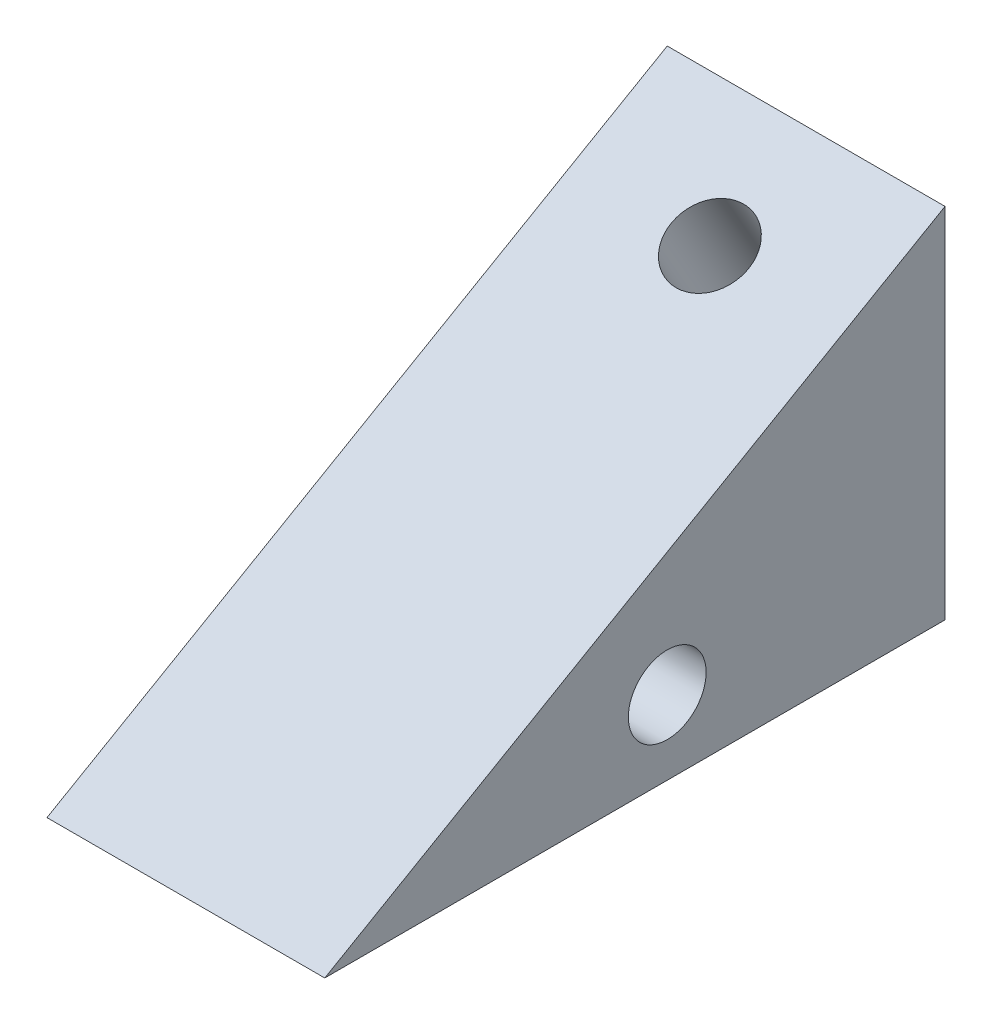
ISO-10303-21;
HEADER;
FILE_DESCRIPTION(('STEP AP214'),'2;1');
FILE_NAME('part.step','',(''),(''),'','','');
FILE_SCHEMA(('AUTOMOTIVE_DESIGN { 1 0 10303 214 1 1 1 1 }'));
ENDSEC;
DATA;
#1=APPLICATION_CONTEXT('core data for automotive mechanical design processes');
#2=APPLICATION_PROTOCOL_DEFINITION('international standard','automotive_design',2000,#1);
#3=PRODUCT_CONTEXT('',#1,'mechanical');
#4=PRODUCT('Part','Part','',(#3));
#5=PRODUCT_RELATED_PRODUCT_CATEGORY('part','',(#4));
#6=PRODUCT_DEFINITION_FORMATION('','',#4);
#7=PRODUCT_DEFINITION_CONTEXT('part definition',#1,'design');
#8=PRODUCT_DEFINITION('design','',#6,#7);
#9=PRODUCT_DEFINITION_SHAPE('','',#8);
#10=(LENGTH_UNIT() NAMED_UNIT(*) SI_UNIT(.MILLI.,.METRE.));
#11=(NAMED_UNIT(*) PLANE_ANGLE_UNIT() SI_UNIT($,.RADIAN.));
#12=(NAMED_UNIT(*) SI_UNIT($,.STERADIAN.) SOLID_ANGLE_UNIT());
#13=UNCERTAINTY_MEASURE_WITH_UNIT(LENGTH_MEASURE(1.E-05),#10,'distance_accuracy_value','');
#14=(GEOMETRIC_REPRESENTATION_CONTEXT(3) GLOBAL_UNCERTAINTY_ASSIGNED_CONTEXT((#13)) GLOBAL_UNIT_ASSIGNED_CONTEXT((#10,
#11,#12)) REPRESENTATION_CONTEXT('',''));
#15=CARTESIAN_POINT('',(0.,0.,0.));
#16=DIRECTION('',(0.,0.,1.));
#17=DIRECTION('',(1.,0.,0.));
#18=AXIS2_PLACEMENT_3D('',#15,#16,#17);
#19=CARTESIAN_POINT('',(15.,19.3357244163885,0.));
#20=DIRECTION('',(0.,0.,1.));
#21=DIRECTION('',(0.,-1.,0.));
#22=AXIS2_PLACEMENT_3D('',#19,#20,#21);
#23=PLANE('',#22);
#24=CARTESIAN_POINT('',(7.5,7.33572441638833,0.));
#25=DIRECTION('',(0.,0.,1.));
#26=DIRECTION('',(0.,1.,0.));
#27=AXIS2_PLACEMENT_3D('',#24,#25,#26);
#28=ELLIPSE('',#27,4.20000000000003,2.09999999999999);
#29=CARTESIAN_POINT('',(7.5,11.5357244163884,0.));
#30=VERTEX_POINT('',#29);
#31=EDGE_CURVE('E135',#30,#30,#28,.T.);
#32=ORIENTED_EDGE('',*,*,#31,.T.);
#33=EDGE_LOOP('',(#32));
#34=FACE_BOUND('',#33,.T.);
#35=DIRECTION('',(0.,1.,0.));
#36=VECTOR('',#35,1.);
#37=CARTESIAN_POINT('',(0.,19.3357244163885,0.));
#38=LINE('',#37,#36);
#39=CARTESIAN_POINT('',(0.,0.,0.));
#40=VERTEX_POINT('',#39);
#41=CARTESIAN_POINT('',(0.,19.3357244163885,0.));
#42=VERTEX_POINT('',#41);
#43=EDGE_CURVE('E93',#40,#42,#38,.T.);
#44=ORIENTED_EDGE('',*,*,#43,.T.);
#45=DIRECTION('',(-1.,0.,0.));
#46=VECTOR('',#45,1.);
#47=CARTESIAN_POINT('',(15.,19.3357244163885,0.));
#48=LINE('',#47,#46);
#49=CARTESIAN_POINT('',(15.,19.3357244163885,0.));
#50=VERTEX_POINT('',#49);
#51=EDGE_CURVE('E11',#50,#42,#48,.T.);
#52=ORIENTED_EDGE('',*,*,#51,.F.);
#53=DIRECTION('',(0.,1.,0.));
#54=VECTOR('',#53,1.);
#55=CARTESIAN_POINT('',(15.,19.3357244163885,0.));
#56=LINE('',#55,#54);
#57=CARTESIAN_POINT('',(15.,0.,0.));
#58=VERTEX_POINT('',#57);
#59=EDGE_CURVE('E85',#58,#50,#56,.T.);
#60=ORIENTED_EDGE('',*,*,#59,.F.);
#61=DIRECTION('',(-1.,0.,0.));
#62=VECTOR('',#61,1.);
#63=CARTESIAN_POINT('',(15.,0.,0.));
#64=LINE('',#63,#62);
#65=EDGE_CURVE('E94',#58,#40,#64,.T.);
#66=ORIENTED_EDGE('',*,*,#65,.T.);
#67=EDGE_LOOP('',(#44,#52,#60,#66));
#68=FACE_BOUND('',#67,.T.);
#69=ADVANCED_FACE('F43',(#34,#68),#23,.F.);
#70=CARTESIAN_POINT('',(15.,0.,33.4904570903353));
#71=DIRECTION('',(0.,-0.866025403784441,-0.499999999999995));
#72=DIRECTION('',(0.,0.499999999999995,-0.866025403784442));
#73=AXIS2_PLACEMENT_3D('',#70,#71,#72);
#74=PLANE('',#73);
#75=CARTESIAN_POINT('',(7.5,16.3357244163885,5.19615242270666));
#76=DIRECTION('',(0.,0.866025403784441,0.499999999999995));
#77=DIRECTION('',(0.,-0.499999999999995,0.866025403784441));
#78=AXIS2_PLACEMENT_3D('',#75,#76,#77);
#79=CIRCLE('',#78,2.09999999999999);
#80=CARTESIAN_POINT('',(7.5,15.2857244163885,7.01480577065398));
#81=VERTEX_POINT('',#80);
#82=EDGE_CURVE('E138',#81,#81,#79,.T.);
#83=ORIENTED_EDGE('',*,*,#82,.F.);
#84=EDGE_LOOP('',(#83));
#85=FACE_BOUND('',#84,.T.);
#86=DIRECTION('',(0.,-0.499999999999995,0.866025403784442));
#87=VECTOR('',#86,1.);
#88=CARTESIAN_POINT('',(0.,0.,33.4904570903353));
#89=LINE('',#88,#87);
#90=CARTESIAN_POINT('',(0.,0.,33.4904570903353));
#91=VERTEX_POINT('',#90);
#92=EDGE_CURVE('E72',#42,#91,#89,.T.);
#93=ORIENTED_EDGE('',*,*,#92,.T.);
#94=DIRECTION('',(-1.,0.,0.));
#95=VECTOR('',#94,1.);
#96=CARTESIAN_POINT('',(15.,0.,33.4904570903353));
#97=LINE('',#96,#95);
#98=CARTESIAN_POINT('',(15.,0.,33.4904570903353));
#99=VERTEX_POINT('',#98);
#100=EDGE_CURVE('E52',#99,#91,#97,.T.);
#101=ORIENTED_EDGE('',*,*,#100,.F.);
#102=DIRECTION('',(0.,-0.499999999999995,0.866025403784442));
#103=VECTOR('',#102,1.);
#104=CARTESIAN_POINT('',(15.,0.,33.4904570903353));
#105=LINE('',#104,#103);
#106=EDGE_CURVE('E80',#50,#99,#105,.T.);
#107=ORIENTED_EDGE('',*,*,#106,.F.);
#108=ORIENTED_EDGE('',*,*,#51,.T.);
#109=EDGE_LOOP('',(#93,#101,#107,#108));
#110=FACE_BOUND('',#109,.T.);
#111=ADVANCED_FACE('F81',(#85,#110),#74,.F.);
#112=CARTESIAN_POINT('',(15.,0.,0.));
#113=DIRECTION('',(0.,1.,0.));
#114=DIRECTION('',(0.,0.,1.));
#115=AXIS2_PLACEMENT_3D('',#112,#113,#114);
#116=PLANE('',#115);
#117=DIRECTION('',(0.,0.,-1.));
#118=VECTOR('',#117,1.);
#119=CARTESIAN_POINT('',(0.,0.,0.));
#120=LINE('',#119,#118);
#121=EDGE_CURVE('E77',#91,#40,#120,.T.);
#122=ORIENTED_EDGE('',*,*,#121,.T.);
#123=ORIENTED_EDGE('',*,*,#65,.F.);
#124=DIRECTION('',(0.,0.,-1.));
#125=VECTOR('',#124,1.);
#126=CARTESIAN_POINT('',(15.,0.,0.));
#127=LINE('',#126,#125);
#128=EDGE_CURVE('E60',#99,#58,#127,.T.);
#129=ORIENTED_EDGE('',*,*,#128,.F.);
#130=ORIENTED_EDGE('',*,*,#100,.T.);
#131=EDGE_LOOP('',(#122,#123,#129,#130));
#132=FACE_BOUND('',#131,.T.);
#133=ADVANCED_FACE('F111',(#132),#116,.F.);
#134=CARTESIAN_POINT('',(15.,0.,0.));
#135=DIRECTION('',(-1.,0.,0.));
#136=DIRECTION('',(0.,0.,1.));
#137=AXIS2_PLACEMENT_3D('',#134,#135,#136);
#138=PLANE('',#137);
#139=CARTESIAN_POINT('',(15.,4.,15.));
#140=DIRECTION('',(1.,0.,0.));
#141=DIRECTION('',(0.,0.,-1.));
#142=AXIS2_PLACEMENT_3D('',#139,#140,#141);
#143=CIRCLE('',#142,2.09999999999999);
#144=CARTESIAN_POINT('',(15.,4.,12.9));
#145=VERTEX_POINT('',#144);
#146=EDGE_CURVE('E103',#145,#145,#143,.T.);
#147=ORIENTED_EDGE('',*,*,#146,.F.);
#148=EDGE_LOOP('',(#147));
#149=FACE_BOUND('',#148,.T.);
#150=ORIENTED_EDGE('',*,*,#59,.T.);
#151=ORIENTED_EDGE('',*,*,#106,.T.);
#152=ORIENTED_EDGE('',*,*,#128,.T.);
#153=EDGE_LOOP('',(#150,#151,#152));
#154=FACE_BOUND('',#153,.T.);
#155=ADVANCED_FACE('F88',(#149,#154),#138,.F.);
#156=CARTESIAN_POINT('',(0.,0.,0.));
#157=DIRECTION('',(-1.,0.,0.));
#158=DIRECTION('',(0.,0.,1.));
#159=AXIS2_PLACEMENT_3D('',#156,#157,#158);
#160=PLANE('',#159);
#161=CARTESIAN_POINT('',(0.,4.,15.));
#162=DIRECTION('',(1.,0.,0.));
#163=DIRECTION('',(0.,0.,-1.));
#164=AXIS2_PLACEMENT_3D('',#161,#162,#163);
#165=CIRCLE('',#164,2.1);
#166=CARTESIAN_POINT('',(0.,4.,12.9));
#167=VERTEX_POINT('',#166);
#168=EDGE_CURVE('E97',#167,#167,#165,.T.);
#169=ORIENTED_EDGE('',*,*,#168,.T.);
#170=EDGE_LOOP('',(#169));
#171=FACE_BOUND('',#170,.T.);
#172=ORIENTED_EDGE('',*,*,#43,.F.);
#173=ORIENTED_EDGE('',*,*,#121,.F.);
#174=ORIENTED_EDGE('',*,*,#92,.F.);
#175=EDGE_LOOP('',(#172,#173,#174));
#176=FACE_BOUND('',#175,.T.);
#177=ADVANCED_FACE('F112',(#171,#176),#160,.T.);
#178=CARTESIAN_POINT('',(15.,4.,15.));
#179=DIRECTION('',(1.,0.,0.));
#180=DIRECTION('',(0.,0.,-1.));
#181=AXIS2_PLACEMENT_3D('',#178,#179,#180);
#182=CYLINDRICAL_SURFACE('',#181,2.09999999999999);
#183=ORIENTED_EDGE('',*,*,#168,.F.);
#184=EDGE_LOOP('',(#183));
#185=FACE_BOUND('',#184,.T.);
#186=ORIENTED_EDGE('',*,*,#146,.T.);
#187=EDGE_LOOP('',(#186));
#188=FACE_BOUND('',#187,.T.);
#189=ADVANCED_FACE('F114',(#185,#188),#182,.F.);
#190=CARTESIAN_POINT('',(7.5,16.3357244163885,5.19615242270666));
#191=DIRECTION('',(0.,0.866025403784441,0.499999999999995));
#192=DIRECTION('',(0.,-0.499999999999995,0.866025403784441));
#193=AXIS2_PLACEMENT_3D('',#190,#191,#192);
#194=CYLINDRICAL_SURFACE('',#193,2.09999999999999);
#195=ORIENTED_EDGE('',*,*,#82,.T.);
#196=EDGE_LOOP('',(#195));
#197=FACE_BOUND('',#196,.T.);
#198=ORIENTED_EDGE('',*,*,#31,.F.);
#199=EDGE_LOOP('',(#198));
#200=FACE_BOUND('',#199,.T.);
#201=ADVANCED_FACE('F121',(#197,#200),#194,.F.);
#202=CLOSED_SHELL('',(#69,#111,#133,#155,#177,#189,#201));
#203=MANIFOLD_SOLID_BREP('B2',#202);
#204=ADVANCED_BREP_SHAPE_REPRESENTATION('',(#18,#203),#14);
#205=SHAPE_DEFINITION_REPRESENTATION(#9,#204);
ENDSEC;
END-ISO-10303-21;
